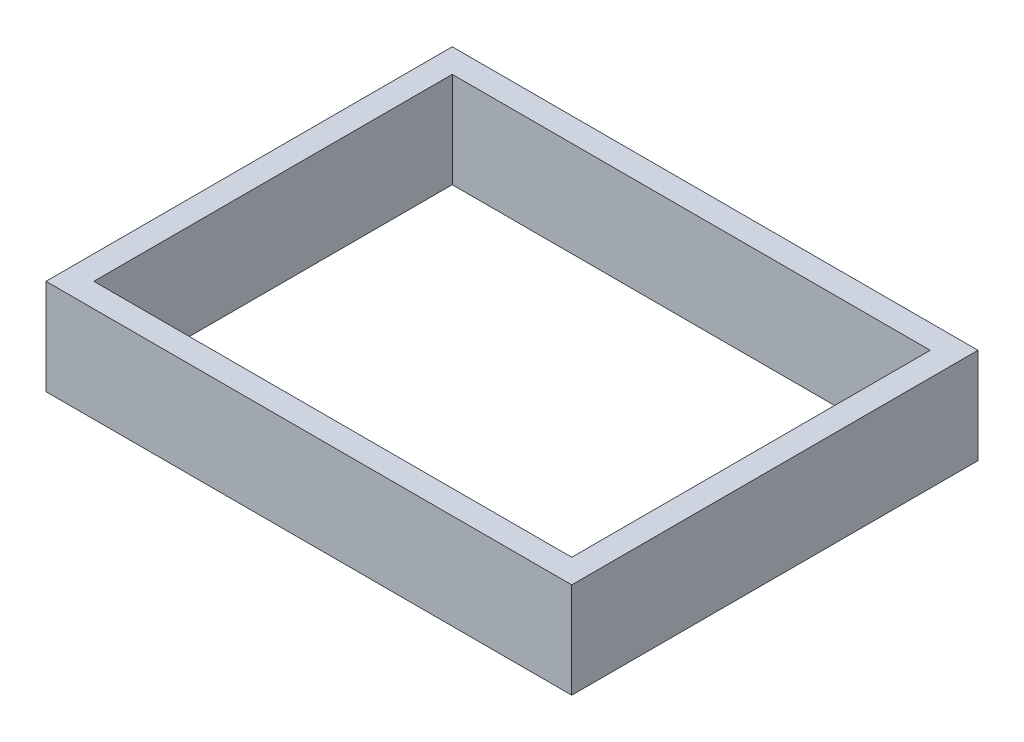
ISO-10303-21;
HEADER;
FILE_DESCRIPTION(('STEP AP214'),'2;1');
FILE_NAME('part.step','',(''),(''),'','','');
FILE_SCHEMA(('AUTOMOTIVE_DESIGN { 1 0 10303 214 1 1 1 1 }'));
ENDSEC;
DATA;
#1=APPLICATION_CONTEXT('core data for automotive mechanical design processes');
#2=APPLICATION_PROTOCOL_DEFINITION('international standard','automotive_design',2000,#1);
#3=PRODUCT_CONTEXT('',#1,'mechanical');
#4=PRODUCT('Part','Part','',(#3));
#5=PRODUCT_RELATED_PRODUCT_CATEGORY('part','',(#4));
#6=PRODUCT_DEFINITION_FORMATION('','',#4);
#7=PRODUCT_DEFINITION_CONTEXT('part definition',#1,'design');
#8=PRODUCT_DEFINITION('design','',#6,#7);
#9=PRODUCT_DEFINITION_SHAPE('','',#8);
#10=(LENGTH_UNIT() NAMED_UNIT(*) SI_UNIT(.MILLI.,.METRE.));
#11=(NAMED_UNIT(*) PLANE_ANGLE_UNIT() SI_UNIT($,.RADIAN.));
#12=(NAMED_UNIT(*) SI_UNIT($,.STERADIAN.) SOLID_ANGLE_UNIT());
#13=UNCERTAINTY_MEASURE_WITH_UNIT(LENGTH_MEASURE(1.E-05),#10,'distance_accuracy_value','');
#14=(GEOMETRIC_REPRESENTATION_CONTEXT(3) GLOBAL_UNCERTAINTY_ASSIGNED_CONTEXT((#13)) GLOBAL_UNIT_ASSIGNED_CONTEXT((#10,
#11,#12)) REPRESENTATION_CONTEXT('',''));
#15=CARTESIAN_POINT('',(0.,0.,0.));
#16=DIRECTION('',(0.,0.,1.));
#17=DIRECTION('',(1.,0.,0.));
#18=AXIS2_PLACEMENT_3D('',#15,#16,#17);
#19=CARTESIAN_POINT('',(0.,40.,0.));
#20=DIRECTION('',(0.,-1.,0.));
#21=DIRECTION('',(0.,0.,-1.));
#22=AXIS2_PLACEMENT_3D('',#19,#20,#21);
#23=PLANE('',#22);
#24=DIRECTION('',(1.,0.,0.));
#25=VECTOR('',#24,1.);
#26=CARTESIAN_POINT('',(-70.4642722740011,40.,68.0762711038027));
#27=LINE('',#26,#25);
#28=CARTESIAN_POINT('',(-70.4642722740011,40.,68.0762711038027));
#29=VERTEX_POINT('',#28);
#30=CARTESIAN_POINT('',(149.535727725999,40.,68.0762711038027));
#31=VERTEX_POINT('',#30);
#32=EDGE_CURVE('E175',#29,#31,#27,.T.);
#33=ORIENTED_EDGE('',*,*,#32,.T.);
#34=DIRECTION('',(0.,0.,1.));
#35=VECTOR('',#34,1.);
#36=CARTESIAN_POINT('',(149.535727725999,40.,-101.923728896197));
#37=LINE('',#36,#35);
#38=CARTESIAN_POINT('',(149.535727725999,40.,-101.923728896197));
#39=VERTEX_POINT('',#38);
#40=EDGE_CURVE('E178',#39,#31,#37,.T.);
#41=ORIENTED_EDGE('',*,*,#40,.F.);
#42=DIRECTION('',(1.,0.,0.));
#43=VECTOR('',#42,1.);
#44=CARTESIAN_POINT('',(-70.4642722740012,40.,-101.923728896197));
#45=LINE('',#44,#43);
#46=CARTESIAN_POINT('',(-70.4642722740012,40.,-101.923728896197));
#47=VERTEX_POINT('',#46);
#48=EDGE_CURVE('E183',#47,#39,#45,.T.);
#49=ORIENTED_EDGE('',*,*,#48,.F.);
#50=DIRECTION('',(0.,0.,1.));
#51=VECTOR('',#50,1.);
#52=CARTESIAN_POINT('',(-70.4642722740012,40.,-101.923728896197));
#53=LINE('',#52,#51);
#54=EDGE_CURVE('E187',#47,#29,#53,.T.);
#55=ORIENTED_EDGE('',*,*,#54,.T.);
#56=EDGE_LOOP('',(#33,#41,#49,#55));
#57=FACE_BOUND('',#56,.T.);
#58=DIRECTION('',(1.,0.,0.));
#59=VECTOR('',#58,1.);
#60=CARTESIAN_POINT('',(-60.4642722740012,40.,58.0762711038027));
#61=LINE('',#60,#59);
#62=CARTESIAN_POINT('',(-60.4642722740012,40.,58.0762711038027));
#63=VERTEX_POINT('',#62);
#64=CARTESIAN_POINT('',(139.535727725999,40.,58.0762711038027));
#65=VERTEX_POINT('',#64);
#66=EDGE_CURVE('E127',#63,#65,#61,.T.);
#67=ORIENTED_EDGE('',*,*,#66,.F.);
#68=DIRECTION('',(0.,0.,1.));
#69=VECTOR('',#68,1.);
#70=CARTESIAN_POINT('',(-60.4642722740012,40.,-91.9237288961973));
#71=LINE('',#70,#69);
#72=CARTESIAN_POINT('',(-60.4642722740012,40.,-91.9237288961973));
#73=VERTEX_POINT('',#72);
#74=EDGE_CURVE('E152',#73,#63,#71,.T.);
#75=ORIENTED_EDGE('',*,*,#74,.F.);
#76=DIRECTION('',(1.,0.,0.));
#77=VECTOR('',#76,1.);
#78=CARTESIAN_POINT('',(-60.4642722740012,40.,-91.9237288961973));
#79=LINE('',#78,#77);
#80=CARTESIAN_POINT('',(139.535727725999,40.,-91.9237288961973));
#81=VERTEX_POINT('',#80);
#82=EDGE_CURVE('E79',#73,#81,#79,.T.);
#83=ORIENTED_EDGE('',*,*,#82,.T.);
#84=DIRECTION('',(0.,0.,1.));
#85=VECTOR('',#84,1.);
#86=CARTESIAN_POINT('',(139.535727725999,40.,-91.9237288961973));
#87=LINE('',#86,#85);
#88=EDGE_CURVE('E137',#81,#65,#87,.T.);
#89=ORIENTED_EDGE('',*,*,#88,.T.);
#90=EDGE_LOOP('',(#67,#75,#83,#89));
#91=FACE_BOUND('',#90,.T.);
#92=ADVANCED_FACE('F63',(#57,#91),#23,.F.);
#93=CARTESIAN_POINT('',(0.,0.,0.));
#94=DIRECTION('',(0.,-1.,0.));
#95=DIRECTION('',(0.,0.,-1.));
#96=AXIS2_PLACEMENT_3D('',#93,#94,#95);
#97=PLANE('',#96);
#98=DIRECTION('',(1.,0.,0.));
#99=VECTOR('',#98,1.);
#100=CARTESIAN_POINT('',(-70.4642722740011,0.,68.0762711038027));
#101=LINE('',#100,#99);
#102=CARTESIAN_POINT('',(-70.4642722740011,0.,68.0762711038027));
#103=VERTEX_POINT('',#102);
#104=CARTESIAN_POINT('',(149.535727725999,0.,68.0762711038027));
#105=VERTEX_POINT('',#104);
#106=EDGE_CURVE('E146',#103,#105,#101,.T.);
#107=ORIENTED_EDGE('',*,*,#106,.F.);
#108=DIRECTION('',(0.,0.,1.));
#109=VECTOR('',#108,1.);
#110=CARTESIAN_POINT('',(-70.4642722740012,0.,-101.923728896197));
#111=LINE('',#110,#109);
#112=CARTESIAN_POINT('',(-70.4642722740012,0.,-101.923728896197));
#113=VERTEX_POINT('',#112);
#114=EDGE_CURVE('E179',#113,#103,#111,.T.);
#115=ORIENTED_EDGE('',*,*,#114,.F.);
#116=DIRECTION('',(1.,0.,0.));
#117=VECTOR('',#116,1.);
#118=CARTESIAN_POINT('',(-70.4642722740012,0.,-101.923728896197));
#119=LINE('',#118,#117);
#120=CARTESIAN_POINT('',(149.535727725999,0.,-101.923728896197));
#121=VERTEX_POINT('',#120);
#122=EDGE_CURVE('E198',#113,#121,#119,.T.);
#123=ORIENTED_EDGE('',*,*,#122,.T.);
#124=DIRECTION('',(0.,0.,1.));
#125=VECTOR('',#124,1.);
#126=CARTESIAN_POINT('',(149.535727725999,0.,-101.923728896197));
#127=LINE('',#126,#125);
#128=EDGE_CURVE('E194',#121,#105,#127,.T.);
#129=ORIENTED_EDGE('',*,*,#128,.T.);
#130=EDGE_LOOP('',(#107,#115,#123,#129));
#131=FACE_BOUND('',#130,.T.);
#132=DIRECTION('',(0.,0.,1.));
#133=VECTOR('',#132,1.);
#134=CARTESIAN_POINT('',(-60.4642722740012,0.,-91.9237288961973));
#135=LINE('',#134,#133);
#136=CARTESIAN_POINT('',(-60.4642722740012,0.,-91.9237288961973));
#137=VERTEX_POINT('',#136);
#138=CARTESIAN_POINT('',(-60.4642722740012,0.,58.0762711038027));
#139=VERTEX_POINT('',#138);
#140=EDGE_CURVE('E138',#137,#139,#135,.T.);
#141=ORIENTED_EDGE('',*,*,#140,.T.);
#142=DIRECTION('',(1.,0.,0.));
#143=VECTOR('',#142,1.);
#144=CARTESIAN_POINT('',(-60.4642722740012,0.,58.0762711038027));
#145=LINE('',#144,#143);
#146=CARTESIAN_POINT('',(139.535727725999,0.,58.0762711038027));
#147=VERTEX_POINT('',#146);
#148=EDGE_CURVE('E87',#139,#147,#145,.T.);
#149=ORIENTED_EDGE('',*,*,#148,.T.);
#150=DIRECTION('',(0.,0.,1.));
#151=VECTOR('',#150,1.);
#152=CARTESIAN_POINT('',(139.535727725999,0.,-91.9237288961973));
#153=LINE('',#152,#151);
#154=CARTESIAN_POINT('',(139.535727725999,0.,-91.9237288961973));
#155=VERTEX_POINT('',#154);
#156=EDGE_CURVE('E144',#155,#147,#153,.T.);
#157=ORIENTED_EDGE('',*,*,#156,.F.);
#158=DIRECTION('',(1.,0.,0.));
#159=VECTOR('',#158,1.);
#160=CARTESIAN_POINT('',(-60.4642722740012,0.,-91.9237288961973));
#161=LINE('',#160,#159);
#162=EDGE_CURVE('E161',#137,#155,#161,.T.);
#163=ORIENTED_EDGE('',*,*,#162,.F.);
#164=EDGE_LOOP('',(#141,#149,#157,#163));
#165=FACE_BOUND('',#164,.T.);
#166=ADVANCED_FACE('F222',(#131,#165),#97,.T.);
#167=CARTESIAN_POINT('',(-70.4642722740011,40.,68.0762711038027));
#168=DIRECTION('',(0.,0.,-1.));
#169=DIRECTION('',(-1.,0.,0.));
#170=AXIS2_PLACEMENT_3D('',#167,#168,#169);
#171=PLANE('',#170);
#172=ORIENTED_EDGE('',*,*,#106,.T.);
#173=DIRECTION('',(0.,-1.,0.));
#174=VECTOR('',#173,1.);
#175=CARTESIAN_POINT('',(149.535727725999,40.,68.0762711038027));
#176=LINE('',#175,#174);
#177=EDGE_CURVE('E12',#31,#105,#176,.T.);
#178=ORIENTED_EDGE('',*,*,#177,.F.);
#179=ORIENTED_EDGE('',*,*,#32,.F.);
#180=DIRECTION('',(0.,-1.,0.));
#181=VECTOR('',#180,1.);
#182=CARTESIAN_POINT('',(-70.4642722740011,40.,68.0762711038027));
#183=LINE('',#182,#181);
#184=EDGE_CURVE('E190',#29,#103,#183,.T.);
#185=ORIENTED_EDGE('',*,*,#184,.T.);
#186=EDGE_LOOP('',(#172,#178,#179,#185));
#187=FACE_BOUND('',#186,.T.);
#188=ADVANCED_FACE('F65',(#187),#171,.F.);
#189=CARTESIAN_POINT('',(149.535727725999,40.,-101.923728896197));
#190=DIRECTION('',(1.,0.,0.));
#191=DIRECTION('',(0.,0.,-1.));
#192=AXIS2_PLACEMENT_3D('',#189,#190,#191);
#193=PLANE('',#192);
#194=ORIENTED_EDGE('',*,*,#128,.F.);
#195=DIRECTION('',(0.,-1.,0.));
#196=VECTOR('',#195,1.);
#197=CARTESIAN_POINT('',(149.535727725999,40.,-101.923728896197));
#198=LINE('',#197,#196);
#199=EDGE_CURVE('E72',#39,#121,#198,.T.);
#200=ORIENTED_EDGE('',*,*,#199,.F.);
#201=ORIENTED_EDGE('',*,*,#40,.T.);
#202=ORIENTED_EDGE('',*,*,#177,.T.);
#203=EDGE_LOOP('',(#194,#200,#201,#202));
#204=FACE_BOUND('',#203,.T.);
#205=ADVANCED_FACE('F217',(#204),#193,.T.);
#206=CARTESIAN_POINT('',(-70.4642722740012,40.,-101.923728896197));
#207=DIRECTION('',(0.,0.,-1.));
#208=DIRECTION('',(-1.,0.,0.));
#209=AXIS2_PLACEMENT_3D('',#206,#207,#208);
#210=PLANE('',#209);
#211=ORIENTED_EDGE('',*,*,#122,.F.);
#212=DIRECTION('',(0.,-1.,0.));
#213=VECTOR('',#212,1.);
#214=CARTESIAN_POINT('',(-70.4642722740012,40.,-101.923728896197));
#215=LINE('',#214,#213);
#216=EDGE_CURVE('E207',#47,#113,#215,.T.);
#217=ORIENTED_EDGE('',*,*,#216,.F.);
#218=ORIENTED_EDGE('',*,*,#48,.T.);
#219=ORIENTED_EDGE('',*,*,#199,.T.);
#220=EDGE_LOOP('',(#211,#217,#218,#219));
#221=FACE_BOUND('',#220,.T.);
#222=ADVANCED_FACE('F213',(#221),#210,.T.);
#223=CARTESIAN_POINT('',(-70.4642722740012,40.,-101.923728896197));
#224=DIRECTION('',(1.,0.,0.));
#225=DIRECTION('',(0.,0.,-1.));
#226=AXIS2_PLACEMENT_3D('',#223,#224,#225);
#227=PLANE('',#226);
#228=ORIENTED_EDGE('',*,*,#114,.T.);
#229=ORIENTED_EDGE('',*,*,#184,.F.);
#230=ORIENTED_EDGE('',*,*,#54,.F.);
#231=ORIENTED_EDGE('',*,*,#216,.T.);
#232=EDGE_LOOP('',(#228,#229,#230,#231));
#233=FACE_BOUND('',#232,.T.);
#234=ADVANCED_FACE('F226',(#233),#227,.F.);
#235=CARTESIAN_POINT('',(-60.4642722740012,40.,58.0762711038027));
#236=DIRECTION('',(0.,0.,-1.));
#237=DIRECTION('',(-1.,0.,0.));
#238=AXIS2_PLACEMENT_3D('',#235,#236,#237);
#239=PLANE('',#238);
#240=ORIENTED_EDGE('',*,*,#148,.F.);
#241=DIRECTION('',(0.,-1.,0.));
#242=VECTOR('',#241,1.);
#243=CARTESIAN_POINT('',(-60.4642722740012,40.,58.0762711038027));
#244=LINE('',#243,#242);
#245=EDGE_CURVE('E132',#63,#139,#244,.T.);
#246=ORIENTED_EDGE('',*,*,#245,.F.);
#247=ORIENTED_EDGE('',*,*,#66,.T.);
#248=DIRECTION('',(0.,-1.,0.));
#249=VECTOR('',#248,1.);
#250=CARTESIAN_POINT('',(139.535727725999,40.,58.0762711038027));
#251=LINE('',#250,#249);
#252=EDGE_CURVE('E130',#65,#147,#251,.T.);
#253=ORIENTED_EDGE('',*,*,#252,.T.);
#254=EDGE_LOOP('',(#240,#246,#247,#253));
#255=FACE_BOUND('',#254,.T.);
#256=ADVANCED_FACE('F129',(#255),#239,.T.);
#257=CARTESIAN_POINT('',(139.535727725999,40.,-91.9237288961973));
#258=DIRECTION('',(1.,0.,0.));
#259=DIRECTION('',(0.,0.,-1.));
#260=AXIS2_PLACEMENT_3D('',#257,#258,#259);
#261=PLANE('',#260);
#262=ORIENTED_EDGE('',*,*,#156,.T.);
#263=ORIENTED_EDGE('',*,*,#252,.F.);
#264=ORIENTED_EDGE('',*,*,#88,.F.);
#265=DIRECTION('',(0.,-1.,0.));
#266=VECTOR('',#265,1.);
#267=CARTESIAN_POINT('',(139.535727725999,40.,-91.9237288961973));
#268=LINE('',#267,#266);
#269=EDGE_CURVE('E147',#81,#155,#268,.T.);
#270=ORIENTED_EDGE('',*,*,#269,.T.);
#271=EDGE_LOOP('',(#262,#263,#264,#270));
#272=FACE_BOUND('',#271,.T.);
#273=ADVANCED_FACE('F142',(#272),#261,.F.);
#274=CARTESIAN_POINT('',(-60.4642722740012,40.,-91.9237288961973));
#275=DIRECTION('',(0.,0.,-1.));
#276=DIRECTION('',(-1.,0.,0.));
#277=AXIS2_PLACEMENT_3D('',#274,#275,#276);
#278=PLANE('',#277);
#279=ORIENTED_EDGE('',*,*,#162,.T.);
#280=ORIENTED_EDGE('',*,*,#269,.F.);
#281=ORIENTED_EDGE('',*,*,#82,.F.);
#282=DIRECTION('',(0.,-1.,0.));
#283=VECTOR('',#282,1.);
#284=CARTESIAN_POINT('',(-60.4642722740012,40.,-91.9237288961973));
#285=LINE('',#284,#283);
#286=EDGE_CURVE('E170',#73,#137,#285,.T.);
#287=ORIENTED_EDGE('',*,*,#286,.T.);
#288=EDGE_LOOP('',(#279,#280,#281,#287));
#289=FACE_BOUND('',#288,.T.);
#290=ADVANCED_FACE('F289',(#289),#278,.F.);
#291=CARTESIAN_POINT('',(-60.4642722740012,40.,-91.9237288961973));
#292=DIRECTION('',(1.,0.,0.));
#293=DIRECTION('',(0.,0.,-1.));
#294=AXIS2_PLACEMENT_3D('',#291,#292,#293);
#295=PLANE('',#294);
#296=ORIENTED_EDGE('',*,*,#140,.F.);
#297=ORIENTED_EDGE('',*,*,#286,.F.);
#298=ORIENTED_EDGE('',*,*,#74,.T.);
#299=ORIENTED_EDGE('',*,*,#245,.T.);
#300=EDGE_LOOP('',(#296,#297,#298,#299));
#301=FACE_BOUND('',#300,.T.);
#302=ADVANCED_FACE('F296',(#301),#295,.T.);
#303=CLOSED_SHELL('',(#92,#166,#188,#205,#222,#234,#256,#273,#290,#302));
#304=MANIFOLD_SOLID_BREP('B2',#303);
#305=ADVANCED_BREP_SHAPE_REPRESENTATION('',(#18,#304),#14);
#306=SHAPE_DEFINITION_REPRESENTATION(#9,#305);
ENDSEC;
END-ISO-10303-21;
